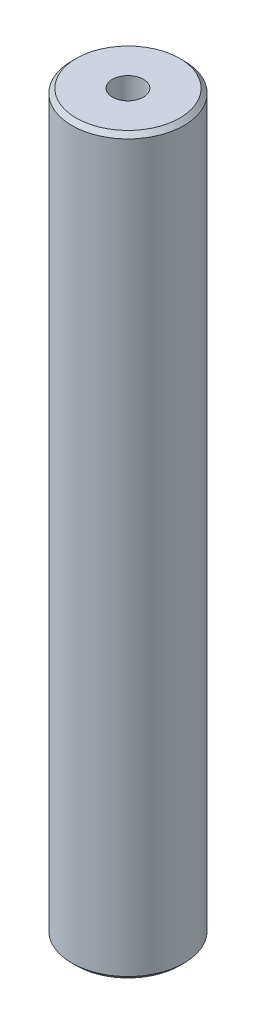
ISO-10303-21;
HEADER;
FILE_DESCRIPTION(('STEP AP214'),'2;1');
FILE_NAME('part.step','',(''),(''),'','','');
FILE_SCHEMA(('AUTOMOTIVE_DESIGN { 1 0 10303 214 1 1 1 1 }'));
ENDSEC;
DATA;
#1=APPLICATION_CONTEXT('core data for automotive mechanical design processes');
#2=APPLICATION_PROTOCOL_DEFINITION('international standard','automotive_design',2000,#1);
#3=PRODUCT_CONTEXT('',#1,'mechanical');
#4=PRODUCT('Part','Part','',(#3));
#5=PRODUCT_RELATED_PRODUCT_CATEGORY('part','',(#4));
#6=PRODUCT_DEFINITION_FORMATION('','',#4);
#7=PRODUCT_DEFINITION_CONTEXT('part definition',#1,'design');
#8=PRODUCT_DEFINITION('design','',#6,#7);
#9=PRODUCT_DEFINITION_SHAPE('','',#8);
#10=(LENGTH_UNIT() NAMED_UNIT(*) SI_UNIT(.MILLI.,.METRE.));
#11=(NAMED_UNIT(*) PLANE_ANGLE_UNIT() SI_UNIT($,.RADIAN.));
#12=(NAMED_UNIT(*) SI_UNIT($,.STERADIAN.) SOLID_ANGLE_UNIT());
#13=UNCERTAINTY_MEASURE_WITH_UNIT(LENGTH_MEASURE(1.E-05),#10,'distance_accuracy_value','');
#14=(GEOMETRIC_REPRESENTATION_CONTEXT(3) GLOBAL_UNCERTAINTY_ASSIGNED_CONTEXT((#13)) GLOBAL_UNIT_ASSIGNED_CONTEXT((#10,
#11,#12)) REPRESENTATION_CONTEXT('',''));
#15=CARTESIAN_POINT('',(0.,0.,0.));
#16=DIRECTION('',(0.,0.,1.));
#17=DIRECTION('',(1.,0.,0.));
#18=AXIS2_PLACEMENT_3D('',#15,#16,#17);
#19=CARTESIAN_POINT('',(0.,196.479799854133,0.));
#20=DIRECTION('',(0.,-1.,0.));
#21=DIRECTION('',(0.,0.,-1.));
#22=AXIS2_PLACEMENT_3D('',#19,#20,#21);
#23=CYLINDRICAL_SURFACE('',#22,15.);
#24=CARTESIAN_POINT('',(0.,195.325745727512,0.));
#25=DIRECTION('',(0.,1.,0.));
#26=DIRECTION('',(0.,0.,1.));
#27=AXIS2_PLACEMENT_3D('',#24,#25,#26);
#28=CIRCLE('',#27,15.);
#29=CARTESIAN_POINT('',(0.,195.325745727512,15.));
#30=VERTEX_POINT('',#29);
#31=EDGE_CURVE('E50',#30,#30,#28,.F.);
#32=ORIENTED_EDGE('',*,*,#31,.T.);
#33=EDGE_LOOP('',(#32));
#34=FACE_BOUND('',#33,.T.);
#35=CARTESIAN_POINT('',(0.,1.15405412662106,0.));
#36=DIRECTION('',(0.,1.,0.));
#37=DIRECTION('',(0.,0.,1.));
#38=AXIS2_PLACEMENT_3D('',#35,#36,#37);
#39=CIRCLE('',#38,15.);
#40=CARTESIAN_POINT('',(0.,1.15405412662106,15.));
#41=VERTEX_POINT('',#40);
#42=EDGE_CURVE('E51',#41,#41,#39,.T.);
#43=ORIENTED_EDGE('',*,*,#42,.T.);
#44=EDGE_LOOP('',(#43));
#45=FACE_BOUND('',#44,.T.);
#46=ADVANCED_FACE('F39',(#34,#45),#23,.T.);
#47=CARTESIAN_POINT('',(0.,196.479799854133,0.));
#48=DIRECTION('',(0.,1.,0.));
#49=DIRECTION('',(0.,0.,1.));
#50=AXIS2_PLACEMENT_3D('',#47,#48,#49);
#51=PLANE('',#50);
#52=CARTESIAN_POINT('',(0.,196.479799854133,0.));
#53=DIRECTION('',(0.,1.,0.));
#54=DIRECTION('',(0.,0.,1.));
#55=AXIS2_PLACEMENT_3D('',#52,#53,#54);
#56=CIRCLE('',#55,13.845945873379);
#57=CARTESIAN_POINT('',(0.,196.479799854133,13.845945873379));
#58=VERTEX_POINT('',#57);
#59=EDGE_CURVE('E54',#58,#58,#56,.T.);
#60=ORIENTED_EDGE('',*,*,#59,.T.);
#61=EDGE_LOOP('',(#60));
#62=FACE_BOUND('',#61,.T.);
#63=CARTESIAN_POINT('',(0.,196.479799854133,0.));
#64=DIRECTION('',(0.,1.,0.));
#65=DIRECTION('',(0.,0.,1.));
#66=AXIS2_PLACEMENT_3D('',#63,#64,#65);
#67=CIRCLE('',#66,4.1503378450814);
#68=CARTESIAN_POINT('',(0.,196.479799854133,4.1503378450814));
#69=VERTEX_POINT('',#68);
#70=EDGE_CURVE('E58',#69,#69,#67,.T.);
#71=ORIENTED_EDGE('',*,*,#70,.F.);
#72=EDGE_LOOP('',(#71));
#73=FACE_BOUND('',#72,.T.);
#74=ADVANCED_FACE('F69',(#62,#73),#51,.T.);
#75=CARTESIAN_POINT('',(0.,0.,0.));
#76=DIRECTION('',(0.,1.,0.));
#77=DIRECTION('',(0.,0.,1.));
#78=AXIS2_PLACEMENT_3D('',#75,#76,#77);
#79=PLANE('',#78);
#80=CARTESIAN_POINT('',(0.,0.,0.));
#81=DIRECTION('',(0.,1.,0.));
#82=DIRECTION('',(0.,0.,1.));
#83=AXIS2_PLACEMENT_3D('',#80,#81,#82);
#84=CIRCLE('',#83,13.845945873379);
#85=CARTESIAN_POINT('',(0.,0.,13.845945873379));
#86=VERTEX_POINT('',#85);
#87=EDGE_CURVE('E10',#86,#86,#84,.F.);
#88=ORIENTED_EDGE('',*,*,#87,.T.);
#89=EDGE_LOOP('',(#88));
#90=FACE_BOUND('',#89,.T.);
#91=CARTESIAN_POINT('',(0.,0.,0.));
#92=DIRECTION('',(0.,1.,0.));
#93=DIRECTION('',(0.,0.,1.));
#94=AXIS2_PLACEMENT_3D('',#91,#92,#93);
#95=CIRCLE('',#94,4.1503378450814);
#96=CARTESIAN_POINT('',(0.,0.,4.1503378450814));
#97=VERTEX_POINT('',#96);
#98=EDGE_CURVE('E63',#97,#97,#95,.T.);
#99=ORIENTED_EDGE('',*,*,#98,.T.);
#100=EDGE_LOOP('',(#99));
#101=FACE_BOUND('',#100,.T.);
#102=ADVANCED_FACE('F75',(#90,#101),#79,.F.);
#103=CARTESIAN_POINT('',(0.,196.479799854133,0.));
#104=DIRECTION('',(0.,-1.,0.));
#105=DIRECTION('',(0.,0.,-1.));
#106=AXIS2_PLACEMENT_3D('',#103,#104,#105);
#107=CYLINDRICAL_SURFACE('',#106,4.1503378450814);
#108=ORIENTED_EDGE('',*,*,#70,.T.);
#109=EDGE_LOOP('',(#108));
#110=FACE_BOUND('',#109,.T.);
#111=ORIENTED_EDGE('',*,*,#98,.F.);
#112=EDGE_LOOP('',(#111));
#113=FACE_BOUND('',#112,.T.);
#114=ADVANCED_FACE('F70',(#110,#113),#107,.F.);
#115=CARTESIAN_POINT('',(0.,196.479799854133,0.));
#116=DIRECTION('',(0.,-1.,0.));
#117=DIRECTION('',(0.,0.,-1.));
#118=AXIS2_PLACEMENT_3D('',#115,#116,#117);
#119=CONICAL_SURFACE('',#118,13.845945873379,0.78539816339743);
#120=ORIENTED_EDGE('',*,*,#31,.F.);
#121=EDGE_LOOP('',(#120));
#122=FACE_BOUND('',#121,.T.);
#123=ORIENTED_EDGE('',*,*,#59,.F.);
#124=EDGE_LOOP('',(#123));
#125=FACE_BOUND('',#124,.T.);
#126=ADVANCED_FACE('F81',(#122,#125),#119,.T.);
#127=CARTESIAN_POINT('',(0.,1.15405412662106,0.));
#128=DIRECTION('',(0.,1.,0.));
#129=DIRECTION('',(0.,0.,1.));
#130=AXIS2_PLACEMENT_3D('',#127,#128,#129);
#131=CONICAL_SURFACE('',#130,15.,0.78539816339743);
#132=CARTESIAN_POINT('',(0.,0.,13.845945873379));
#133=CARTESIAN_POINT('',(0.,0.0120213971523023,13.8579672705313));
#134=CARTESIAN_POINT('',(0.,0.0240427943046052,13.8699886676836));
#135=CARTESIAN_POINT('',(0.,0.0480855886092108,13.8940314619882));
#136=CARTESIAN_POINT('',(0.,0.0601069857615136,13.9060528591405));
#137=CARTESIAN_POINT('',(0.,0.084149780066119,13.9300956534451));
#138=CARTESIAN_POINT('',(0.,0.0961711772184215,13.9421170505974));
#139=CARTESIAN_POINT('',(0.,0.120213971523027,13.966159844902));
#140=CARTESIAN_POINT('',(0.,0.13223536867533,13.9781812420543));
#141=CARTESIAN_POINT('',(0.,0.156278162979935,14.0022240363589));
#142=CARTESIAN_POINT('',(0.,0.168299560132238,14.0142454335112));
#143=CARTESIAN_POINT('',(0.,0.192342354436843,14.0382882278158));
#144=CARTESIAN_POINT('',(0.,0.204363751589146,14.0503096249681));
#145=CARTESIAN_POINT('',(0.,0.228406545893752,14.0743524192727));
#146=CARTESIAN_POINT('',(0.,0.240427943046055,14.086373816425));
#147=CARTESIAN_POINT('',(0.,0.26447073735066,14.1104166107296));
#148=CARTESIAN_POINT('',(0.,0.276492134502962,14.1224380078819));
#149=CARTESIAN_POINT('',(0.,0.300534928807568,14.1464808021865));
#150=CARTESIAN_POINT('',(0.,0.312556325959871,14.1585021993388));
#151=CARTESIAN_POINT('',(0.,0.336599120264476,14.1825449936434));
#152=CARTESIAN_POINT('',(0.,0.348620517416779,14.1945663907957));
#153=CARTESIAN_POINT('',(0.,0.372663311721385,14.2186091851003));
#154=CARTESIAN_POINT('',(0.,0.384684708873687,14.2306305822527));
#155=CARTESIAN_POINT('',(0.,0.408727503178292,14.2546733765573));
#156=CARTESIAN_POINT('',(0.,0.420748900330595,14.2666947737096));
#157=CARTESIAN_POINT('',(0.,0.444791694635201,14.2907375680142));
#158=CARTESIAN_POINT('',(0.,0.456813091787504,14.3027589651665));
#159=CARTESIAN_POINT('',(0.,0.480855886092109,14.3268017594711));
#160=CARTESIAN_POINT('',(0.,0.492877283244412,14.3388231566234));
#161=CARTESIAN_POINT('',(0.,0.516920077549017,14.362865950928));
#162=CARTESIAN_POINT('',(0.,0.52894147470132,14.3748873480803));
#163=CARTESIAN_POINT('',(0.,0.552984269005925,14.3989301423849));
#164=CARTESIAN_POINT('',(0.,0.565005666158228,14.4109515395372));
#165=CARTESIAN_POINT('',(0.,0.589048460462834,14.4349943338418));
#166=CARTESIAN_POINT('',(0.,0.601069857615136,14.4470157309941));
#167=CARTESIAN_POINT('',(0.,0.625112651919742,14.4710585252987));
#168=CARTESIAN_POINT('',(0.,0.637134049072045,14.483079922451));
#169=CARTESIAN_POINT('',(0.,0.66117684337665,14.5071227167556));
#170=CARTESIAN_POINT('',(0.,0.673198240528953,14.5191441139079));
#171=CARTESIAN_POINT('',(0.,0.697241034833558,14.5431869082125));
#172=CARTESIAN_POINT('',(0.,0.709262431985861,14.5552083053648));
#173=CARTESIAN_POINT('',(0.,0.733305226290467,14.5792510996694));
#174=CARTESIAN_POINT('',(0.,0.745326623442769,14.5912724968217));
#175=CARTESIAN_POINT('',(0.,0.769369417747375,14.6153152911263));
#176=CARTESIAN_POINT('',(0.,0.781390814899678,14.6273366882786));
#177=CARTESIAN_POINT('',(0.,0.805433609204283,14.6513794825832));
#178=CARTESIAN_POINT('',(0.,0.817455006356586,14.6634008797355));
#179=CARTESIAN_POINT('',(0.,0.841497800661191,14.6874436740401));
#180=CARTESIAN_POINT('',(0.,0.853519197813494,14.6994650711924));
#181=CARTESIAN_POINT('',(0.,0.877561992118099,14.723507865497));
#182=CARTESIAN_POINT('',(0.,0.889583389270402,14.7355292626493));
#183=CARTESIAN_POINT('',(0.,0.913626183575008,14.759572056954));
#184=CARTESIAN_POINT('',(0.,0.92564758072731,14.7715934541063));
#185=CARTESIAN_POINT('',(0.,0.949690375031916,14.7956362484109));
#186=CARTESIAN_POINT('',(0.,0.961711772184218,14.8076576455632));
#187=CARTESIAN_POINT('',(0.,0.985754566488824,14.8317004398678));
#188=CARTESIAN_POINT('',(0.,0.997775963641127,14.8437218370201));
#189=CARTESIAN_POINT('',(0.,1.02181875794573,14.8677646313247));
#190=CARTESIAN_POINT('',(0.,1.03384015509803,14.879786028477));
#191=CARTESIAN_POINT('',(0.,1.05788294940264,14.9038288227816));
#192=CARTESIAN_POINT('',(0.,1.06990434655494,14.9158502199339));
#193=CARTESIAN_POINT('',(0.,1.09394714085955,14.9398930142385));
#194=CARTESIAN_POINT('',(0.,1.10596853801185,14.9519144113908));
#195=CARTESIAN_POINT('',(0.,1.13001133231646,14.9759572056954));
#196=CARTESIAN_POINT('',(0.,1.14203272946876,14.9879786028477));
#197=CARTESIAN_POINT('',(0.,1.15405412662106,15.));
#198=B_SPLINE_CURVE_WITH_KNOTS('',3,(#132,#133,#134,#135,#136,#137,#138,#139,#140,#141,#142,
#143,#144,#145,#146,#147,#148,#149,#150,#151,#152,#153,#154,#155,#156,#157,#158,#159,#160,#161,
#162,#163,#164,#165,#166,#167,#168,#169,#170,#171,#172,#173,#174,#175,#176,#177,#178,#179,#180,
#181,#182,#183,#184,#185,#186,#187,#188,#189,#190,#191,#192,#193,#194,#195,#196,#197),
.UNSPECIFIED.,.F.,.F.,(4,2,2,2,2,2,2,2,2,2,2,2,2,2,2,2,2,2,2,2,2,2,2,2,2,2,2,2,2,2,2,2,4),(0.,
0.0510024686743783,0.102004937348757,0.153007406023136,0.204009874697514,0.255012343371892,
0.306014812046271,0.357017280720649,0.408019749395028,0.459022218069407,0.510024686743785,
0.561027155418164,0.612029624092543,0.663032092766921,0.714034561441299,0.765037030115679,
0.816039498790057,0.867041967464435,0.918044436138813,0.969046904813193,1.02004937348757,
1.07105184216195,1.12205431083633,1.17305677951071,1.22405924818509,1.27506171685946,
1.32606418553384,1.37706665420822,1.4280691228826,1.47907159155698,1.53007406023136,
1.58107652890574,1.63207899758011),.UNSPECIFIED.);
#199=EDGE_CURVE('BSEAM45',#86,#41,#198,.T.);
#200=ORIENTED_EDGE('',*,*,#87,.F.);
#201=ORIENTED_EDGE('',*,*,#42,.F.);
#202=ORIENTED_EDGE('',*,*,#199,.T.);
#203=ORIENTED_EDGE('',*,*,#199,.F.);
#204=EDGE_LOOP('',(#200,#202,#201,#203));
#205=FACE_BOUND('',#204,.T.);
#206=ADVANCED_FACE('F45',(#205),#131,.T.);
#207=CLOSED_SHELL('',(#46,#74,#102,#114,#126,#206));
#208=MANIFOLD_SOLID_BREP('B2',#207);
#209=ADVANCED_BREP_SHAPE_REPRESENTATION('',(#18,#208),#14);
#210=SHAPE_DEFINITION_REPRESENTATION(#9,#209);
ENDSEC;
END-ISO-10303-21;
